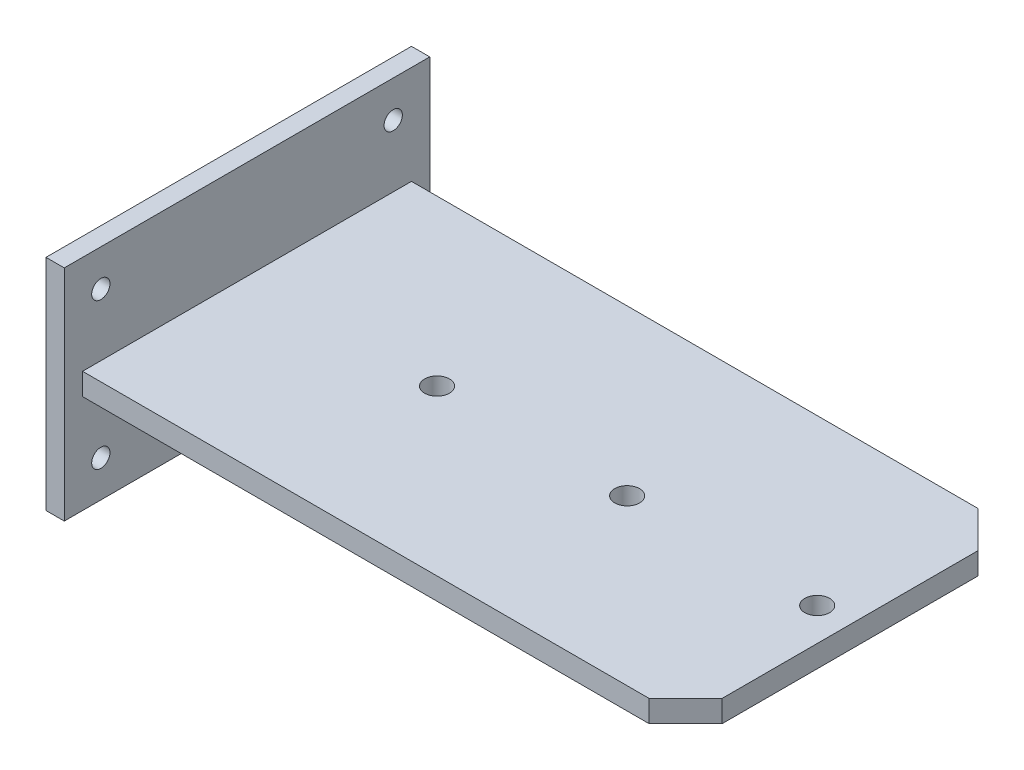
ISO-10303-21;
HEADER;
FILE_DESCRIPTION(('STEP AP214'),'2;1');
FILE_NAME('part.step','',(''),(''),'','','');
FILE_SCHEMA(('AUTOMOTIVE_DESIGN { 1 0 10303 214 1 1 1 1 }'));
ENDSEC;
DATA;
#1=APPLICATION_CONTEXT('core data for automotive mechanical design processes');
#2=APPLICATION_PROTOCOL_DEFINITION('international standard','automotive_design',2000,#1);
#3=PRODUCT_CONTEXT('',#1,'mechanical');
#4=PRODUCT('Part','Part','',(#3));
#5=PRODUCT_RELATED_PRODUCT_CATEGORY('part','',(#4));
#6=PRODUCT_DEFINITION_FORMATION('','',#4);
#7=PRODUCT_DEFINITION_CONTEXT('part definition',#1,'design');
#8=PRODUCT_DEFINITION('design','',#6,#7);
#9=PRODUCT_DEFINITION_SHAPE('','',#8);
#10=(LENGTH_UNIT() NAMED_UNIT(*) SI_UNIT(.MILLI.,.METRE.));
#11=(NAMED_UNIT(*) PLANE_ANGLE_UNIT() SI_UNIT($,.RADIAN.));
#12=(NAMED_UNIT(*) SI_UNIT($,.STERADIAN.) SOLID_ANGLE_UNIT());
#13=UNCERTAINTY_MEASURE_WITH_UNIT(LENGTH_MEASURE(1.E-05),#10,'distance_accuracy_value','');
#14=(GEOMETRIC_REPRESENTATION_CONTEXT(3) GLOBAL_UNCERTAINTY_ASSIGNED_CONTEXT((#13)) GLOBAL_UNIT_ASSIGNED_CONTEXT((#10,
#11,#12)) REPRESENTATION_CONTEXT('',''));
#15=CARTESIAN_POINT('',(0.,0.,0.));
#16=DIRECTION('',(0.,0.,1.));
#17=DIRECTION('',(1.,0.,0.));
#18=AXIS2_PLACEMENT_3D('',#15,#16,#17);
#19=CARTESIAN_POINT('',(5.,-30.,-50.));
#20=DIRECTION('',(0.,0.,1.));
#21=DIRECTION('',(1.,0.,0.));
#22=AXIS2_PLACEMENT_3D('',#19,#20,#21);
#23=PLANE('',#22);
#24=DIRECTION('',(0.,1.,0.));
#25=VECTOR('',#24,1.);
#26=CARTESIAN_POINT('',(0.,-30.,-50.));
#27=LINE('',#26,#25);
#28=CARTESIAN_POINT('',(0.,-30.,-50.));
#29=VERTEX_POINT('',#28);
#30=CARTESIAN_POINT('',(0.,30.,-50.));
#31=VERTEX_POINT('',#30);
#32=EDGE_CURVE('E174',#29,#31,#27,.T.);
#33=ORIENTED_EDGE('',*,*,#32,.T.);
#34=DIRECTION('',(-1.,0.,0.));
#35=VECTOR('',#34,1.);
#36=CARTESIAN_POINT('',(5.,30.,-50.));
#37=LINE('',#36,#35);
#38=CARTESIAN_POINT('',(5.,30.,-50.));
#39=VERTEX_POINT('',#38);
#40=EDGE_CURVE('E11',#39,#31,#37,.T.);
#41=ORIENTED_EDGE('',*,*,#40,.F.);
#42=DIRECTION('',(0.,1.,0.));
#43=VECTOR('',#42,1.);
#44=CARTESIAN_POINT('',(5.,-30.,-50.));
#45=LINE('',#44,#43);
#46=CARTESIAN_POINT('',(5.,-30.,-50.));
#47=VERTEX_POINT('',#46);
#48=EDGE_CURVE('E177',#47,#39,#45,.T.);
#49=ORIENTED_EDGE('',*,*,#48,.F.);
#50=DIRECTION('',(-1.,0.,0.));
#51=VECTOR('',#50,1.);
#52=CARTESIAN_POINT('',(5.,-30.,-50.));
#53=LINE('',#52,#51);
#54=EDGE_CURVE('E183',#47,#29,#53,.T.);
#55=ORIENTED_EDGE('',*,*,#54,.T.);
#56=EDGE_LOOP('',(#33,#41,#49,#55));
#57=FACE_BOUND('',#56,.T.);
#58=ADVANCED_FACE('F35',(#57),#23,.F.);
#59=CARTESIAN_POINT('',(5.,30.,50.));
#60=DIRECTION('',(0.,-1.,0.));
#61=DIRECTION('',(0.,0.,-1.));
#62=AXIS2_PLACEMENT_3D('',#59,#60,#61);
#63=PLANE('',#62);
#64=DIRECTION('',(0.,0.,1.));
#65=VECTOR('',#64,1.);
#66=CARTESIAN_POINT('',(0.,30.,50.));
#67=LINE('',#66,#65);
#68=CARTESIAN_POINT('',(0.,30.,50.));
#69=VERTEX_POINT('',#68);
#70=EDGE_CURVE('E186',#31,#69,#67,.T.);
#71=ORIENTED_EDGE('',*,*,#70,.T.);
#72=DIRECTION('',(-1.,0.,0.));
#73=VECTOR('',#72,1.);
#74=CARTESIAN_POINT('',(5.,30.,50.));
#75=LINE('',#74,#73);
#76=CARTESIAN_POINT('',(5.,30.,50.));
#77=VERTEX_POINT('',#76);
#78=EDGE_CURVE('E42',#77,#69,#75,.T.);
#79=ORIENTED_EDGE('',*,*,#78,.F.);
#80=DIRECTION('',(0.,0.,1.));
#81=VECTOR('',#80,1.);
#82=CARTESIAN_POINT('',(5.,30.,50.));
#83=LINE('',#82,#81);
#84=EDGE_CURVE('E86',#39,#77,#83,.T.);
#85=ORIENTED_EDGE('',*,*,#84,.F.);
#86=ORIENTED_EDGE('',*,*,#40,.T.);
#87=EDGE_LOOP('',(#71,#79,#85,#86));
#88=FACE_BOUND('',#87,.T.);
#89=ADVANCED_FACE('F215',(#88),#63,.F.);
#90=CARTESIAN_POINT('',(5.,-30.,50.));
#91=DIRECTION('',(0.,0.,-1.));
#92=DIRECTION('',(-1.,0.,0.));
#93=AXIS2_PLACEMENT_3D('',#90,#91,#92);
#94=PLANE('',#93);
#95=DIRECTION('',(0.,-1.,0.));
#96=VECTOR('',#95,1.);
#97=CARTESIAN_POINT('',(0.,-30.,50.));
#98=LINE('',#97,#96);
#99=CARTESIAN_POINT('',(0.,-30.,50.));
#100=VERTEX_POINT('',#99);
#101=EDGE_CURVE('E188',#69,#100,#98,.T.);
#102=ORIENTED_EDGE('',*,*,#101,.T.);
#103=DIRECTION('',(-1.,0.,0.));
#104=VECTOR('',#103,1.);
#105=CARTESIAN_POINT('',(5.,-30.,50.));
#106=LINE('',#105,#104);
#107=CARTESIAN_POINT('',(5.,-30.,50.));
#108=VERTEX_POINT('',#107);
#109=EDGE_CURVE('E192',#108,#100,#106,.T.);
#110=ORIENTED_EDGE('',*,*,#109,.F.);
#111=DIRECTION('',(0.,-1.,0.));
#112=VECTOR('',#111,1.);
#113=CARTESIAN_POINT('',(5.,-30.,50.));
#114=LINE('',#113,#112);
#115=EDGE_CURVE('E180',#77,#108,#114,.T.);
#116=ORIENTED_EDGE('',*,*,#115,.F.);
#117=ORIENTED_EDGE('',*,*,#78,.T.);
#118=EDGE_LOOP('',(#102,#110,#116,#117));
#119=FACE_BOUND('',#118,.T.);
#120=ADVANCED_FACE('F197',(#119),#94,.F.);
#121=CARTESIAN_POINT('',(5.,-30.,50.));
#122=DIRECTION('',(0.,1.,0.));
#123=DIRECTION('',(0.,0.,1.));
#124=AXIS2_PLACEMENT_3D('',#121,#122,#123);
#125=PLANE('',#124);
#126=DIRECTION('',(0.,0.,-1.));
#127=VECTOR('',#126,1.);
#128=CARTESIAN_POINT('',(0.,-30.,50.));
#129=LINE('',#128,#127);
#130=EDGE_CURVE('E79',#100,#29,#129,.T.);
#131=ORIENTED_EDGE('',*,*,#130,.T.);
#132=ORIENTED_EDGE('',*,*,#54,.F.);
#133=DIRECTION('',(0.,0.,-1.));
#134=VECTOR('',#133,1.);
#135=CARTESIAN_POINT('',(5.,-30.,50.));
#136=LINE('',#135,#134);
#137=EDGE_CURVE('E58',#108,#47,#136,.T.);
#138=ORIENTED_EDGE('',*,*,#137,.F.);
#139=ORIENTED_EDGE('',*,*,#109,.T.);
#140=EDGE_LOOP('',(#131,#132,#138,#139));
#141=FACE_BOUND('',#140,.T.);
#142=ADVANCED_FACE('F205',(#141),#125,.F.);
#143=CARTESIAN_POINT('',(5.,0.,0.));
#144=DIRECTION('',(-1.,0.,0.));
#145=DIRECTION('',(0.,0.,1.));
#146=AXIS2_PLACEMENT_3D('',#143,#144,#145);
#147=PLANE('',#146);
#148=DIRECTION('',(0.,-1.,0.));
#149=VECTOR('',#148,1.);
#150=CARTESIAN_POINT('',(5.,3.,-45.));
#151=LINE('',#150,#149);
#152=CARTESIAN_POINT('',(5.,3.,-45.));
#153=VERTEX_POINT('',#152);
#154=CARTESIAN_POINT('',(5.,-3.,-45.));
#155=VERTEX_POINT('',#154);
#156=EDGE_CURVE('E152',#153,#155,#151,.T.);
#157=ORIENTED_EDGE('',*,*,#156,.T.);
#158=DIRECTION('',(0.,0.,1.));
#159=VECTOR('',#158,1.);
#160=CARTESIAN_POINT('',(5.,-3.,-45.));
#161=LINE('',#160,#159);
#162=CARTESIAN_POINT('',(5.00000000000002,-3.,45.));
#163=VERTEX_POINT('',#162);
#164=EDGE_CURVE('E49',#155,#163,#161,.T.);
#165=ORIENTED_EDGE('',*,*,#164,.T.);
#166=DIRECTION('',(0.,-1.,0.));
#167=VECTOR('',#166,1.);
#168=CARTESIAN_POINT('',(5.00000000000002,3.,45.));
#169=LINE('',#168,#167);
#170=CARTESIAN_POINT('',(5.00000000000002,3.,45.));
#171=VERTEX_POINT('',#170);
#172=EDGE_CURVE('E427',#171,#163,#169,.T.);
#173=ORIENTED_EDGE('',*,*,#172,.F.);
#174=DIRECTION('',(0.,0.,1.));
#175=VECTOR('',#174,1.);
#176=CARTESIAN_POINT('',(5.,3.,-45.));
#177=LINE('',#176,#175);
#178=EDGE_CURVE('E410',#153,#171,#177,.T.);
#179=ORIENTED_EDGE('',*,*,#178,.F.);
#180=EDGE_LOOP('',(#157,#165,#173,#179));
#181=FACE_BOUND('',#180,.T.);
#182=CARTESIAN_POINT('',(5.,20.,-40.));
#183=DIRECTION('',(1.,0.,0.));
#184=DIRECTION('',(0.,0.,-1.));
#185=AXIS2_PLACEMENT_3D('',#182,#183,#184);
#186=CIRCLE('',#185,2.5);
#187=CARTESIAN_POINT('',(5.,20.,-42.5));
#188=VERTEX_POINT('',#187);
#189=EDGE_CURVE('E150',#188,#188,#186,.T.);
#190=ORIENTED_EDGE('',*,*,#189,.F.);
#191=EDGE_LOOP('',(#190));
#192=FACE_BOUND('',#191,.T.);
#193=CARTESIAN_POINT('',(5.,-20.,-40.));
#194=DIRECTION('',(1.,0.,0.));
#195=DIRECTION('',(0.,0.,-1.));
#196=AXIS2_PLACEMENT_3D('',#193,#194,#195);
#197=CIRCLE('',#196,2.5);
#198=CARTESIAN_POINT('',(5.,-20.,-42.5));
#199=VERTEX_POINT('',#198);
#200=EDGE_CURVE('E163',#199,#199,#197,.T.);
#201=ORIENTED_EDGE('',*,*,#200,.F.);
#202=EDGE_LOOP('',(#201));
#203=FACE_BOUND('',#202,.T.);
#204=CARTESIAN_POINT('',(5.,-20.,40.));
#205=DIRECTION('',(1.,0.,0.));
#206=DIRECTION('',(0.,0.,-1.));
#207=AXIS2_PLACEMENT_3D('',#204,#205,#206);
#208=CIRCLE('',#207,2.5);
#209=CARTESIAN_POINT('',(5.,-20.,37.5));
#210=VERTEX_POINT('',#209);
#211=EDGE_CURVE('E156',#210,#210,#208,.T.);
#212=ORIENTED_EDGE('',*,*,#211,.F.);
#213=EDGE_LOOP('',(#212));
#214=FACE_BOUND('',#213,.T.);
#215=CARTESIAN_POINT('',(5.,20.,40.));
#216=DIRECTION('',(1.,0.,0.));
#217=DIRECTION('',(0.,0.,-1.));
#218=AXIS2_PLACEMENT_3D('',#215,#216,#217);
#219=CIRCLE('',#218,2.5);
#220=CARTESIAN_POINT('',(5.,20.,37.5));
#221=VERTEX_POINT('',#220);
#222=EDGE_CURVE('E171',#221,#221,#219,.T.);
#223=ORIENTED_EDGE('',*,*,#222,.F.);
#224=EDGE_LOOP('',(#223));
#225=FACE_BOUND('',#224,.T.);
#226=ORIENTED_EDGE('',*,*,#48,.T.);
#227=ORIENTED_EDGE('',*,*,#84,.T.);
#228=ORIENTED_EDGE('',*,*,#115,.T.);
#229=ORIENTED_EDGE('',*,*,#137,.T.);
#230=EDGE_LOOP('',(#226,#227,#228,#229));
#231=FACE_BOUND('',#230,.T.);
#232=ADVANCED_FACE('F207',(#181,#192,#203,#214,#225,#231),#147,.F.);
#233=CARTESIAN_POINT('',(0.,0.,0.));
#234=DIRECTION('',(-1.,0.,0.));
#235=DIRECTION('',(0.,0.,1.));
#236=AXIS2_PLACEMENT_3D('',#233,#234,#235);
#237=PLANE('',#236);
#238=CARTESIAN_POINT('',(0.,20.,-40.));
#239=DIRECTION('',(-1.,0.,0.));
#240=DIRECTION('',(0.,0.,1.));
#241=AXIS2_PLACEMENT_3D('',#238,#239,#240);
#242=CIRCLE('',#241,2.5);
#243=CARTESIAN_POINT('',(0.,20.,-37.5));
#244=VERTEX_POINT('',#243);
#245=EDGE_CURVE('E147',#244,#244,#242,.F.);
#246=ORIENTED_EDGE('',*,*,#245,.T.);
#247=EDGE_LOOP('',(#246));
#248=FACE_BOUND('',#247,.T.);
#249=CARTESIAN_POINT('',(0.,-20.,-40.));
#250=DIRECTION('',(-1.,0.,0.));
#251=DIRECTION('',(0.,0.,1.));
#252=AXIS2_PLACEMENT_3D('',#249,#250,#251);
#253=CIRCLE('',#252,2.5);
#254=CARTESIAN_POINT('',(0.,-20.,-37.5));
#255=VERTEX_POINT('',#254);
#256=EDGE_CURVE('E166',#255,#255,#253,.F.);
#257=ORIENTED_EDGE('',*,*,#256,.T.);
#258=EDGE_LOOP('',(#257));
#259=FACE_BOUND('',#258,.T.);
#260=CARTESIAN_POINT('',(0.,-20.,40.));
#261=DIRECTION('',(-1.,0.,0.));
#262=DIRECTION('',(0.,0.,1.));
#263=AXIS2_PLACEMENT_3D('',#260,#261,#262);
#264=CIRCLE('',#263,2.5);
#265=CARTESIAN_POINT('',(0.,-20.,42.5));
#266=VERTEX_POINT('',#265);
#267=EDGE_CURVE('E160',#266,#266,#264,.F.);
#268=ORIENTED_EDGE('',*,*,#267,.T.);
#269=EDGE_LOOP('',(#268));
#270=FACE_BOUND('',#269,.T.);
#271=CARTESIAN_POINT('',(0.,20.,40.));
#272=DIRECTION('',(-1.,0.,0.));
#273=DIRECTION('',(0.,0.,1.));
#274=AXIS2_PLACEMENT_3D('',#271,#272,#273);
#275=CIRCLE('',#274,2.5);
#276=CARTESIAN_POINT('',(0.,20.,42.5));
#277=VERTEX_POINT('',#276);
#278=EDGE_CURVE('E159',#277,#277,#275,.F.);
#279=ORIENTED_EDGE('',*,*,#278,.T.);
#280=EDGE_LOOP('',(#279));
#281=FACE_BOUND('',#280,.T.);
#282=ORIENTED_EDGE('',*,*,#32,.F.);
#283=ORIENTED_EDGE('',*,*,#130,.F.);
#284=ORIENTED_EDGE('',*,*,#101,.F.);
#285=ORIENTED_EDGE('',*,*,#70,.F.);
#286=EDGE_LOOP('',(#282,#283,#284,#285));
#287=FACE_BOUND('',#286,.T.);
#288=ADVANCED_FACE('F201',(#248,#259,#270,#281,#287),#237,.T.);
#289=CARTESIAN_POINT('',(-0.00100000000000013,20.,40.));
#290=DIRECTION('',(1.,0.,0.));
#291=DIRECTION('',(0.,0.,-1.));
#292=AXIS2_PLACEMENT_3D('',#289,#290,#291);
#293=CYLINDRICAL_SURFACE('',#292,2.5);
#294=ORIENTED_EDGE('',*,*,#278,.F.);
#295=EDGE_LOOP('',(#294));
#296=FACE_BOUND('',#295,.T.);
#297=ORIENTED_EDGE('',*,*,#222,.T.);
#298=EDGE_LOOP('',(#297));
#299=FACE_BOUND('',#298,.T.);
#300=ADVANCED_FACE('F242',(#296,#299),#293,.F.);
#301=CARTESIAN_POINT('',(-0.00100000000000013,-20.,40.));
#302=DIRECTION('',(1.,0.,0.));
#303=DIRECTION('',(0.,0.,-1.));
#304=AXIS2_PLACEMENT_3D('',#301,#302,#303);
#305=CYLINDRICAL_SURFACE('',#304,2.5);
#306=ORIENTED_EDGE('',*,*,#267,.F.);
#307=EDGE_LOOP('',(#306));
#308=FACE_BOUND('',#307,.T.);
#309=ORIENTED_EDGE('',*,*,#211,.T.);
#310=EDGE_LOOP('',(#309));
#311=FACE_BOUND('',#310,.T.);
#312=ADVANCED_FACE('F251',(#308,#311),#305,.F.);
#313=CARTESIAN_POINT('',(-0.00100000000000013,-20.,-40.));
#314=DIRECTION('',(1.,0.,0.));
#315=DIRECTION('',(0.,0.,-1.));
#316=AXIS2_PLACEMENT_3D('',#313,#314,#315);
#317=CYLINDRICAL_SURFACE('',#316,2.5);
#318=ORIENTED_EDGE('',*,*,#256,.F.);
#319=EDGE_LOOP('',(#318));
#320=FACE_BOUND('',#319,.T.);
#321=ORIENTED_EDGE('',*,*,#200,.T.);
#322=EDGE_LOOP('',(#321));
#323=FACE_BOUND('',#322,.T.);
#324=ADVANCED_FACE('F261',(#320,#323),#317,.F.);
#325=CARTESIAN_POINT('',(-0.00100000000000013,20.,-40.));
#326=DIRECTION('',(1.,0.,0.));
#327=DIRECTION('',(0.,0.,-1.));
#328=AXIS2_PLACEMENT_3D('',#325,#326,#327);
#329=CYLINDRICAL_SURFACE('',#328,2.5);
#330=ORIENTED_EDGE('',*,*,#245,.F.);
#331=EDGE_LOOP('',(#330));
#332=FACE_BOUND('',#331,.T.);
#333=ORIENTED_EDGE('',*,*,#189,.T.);
#334=EDGE_LOOP('',(#333));
#335=FACE_BOUND('',#334,.T.);
#336=ADVANCED_FACE('F271',(#332,#335),#329,.F.);
#337=CARTESIAN_POINT('',(170.,3.,35.));
#338=DIRECTION('',(-1.,0.,0.));
#339=DIRECTION('',(0.,0.,1.));
#340=AXIS2_PLACEMENT_3D('',#337,#338,#339);
#341=PLANE('',#340);
#342=DIRECTION('',(0.,0.,-1.));
#343=VECTOR('',#342,1.);
#344=CARTESIAN_POINT('',(170.,-3.,35.));
#345=LINE('',#344,#343);
#346=CARTESIAN_POINT('',(170.,-3.,35.));
#347=VERTEX_POINT('',#346);
#348=CARTESIAN_POINT('',(170.,-3.,-35.));
#349=VERTEX_POINT('',#348);
#350=EDGE_CURVE('E146',#347,#349,#345,.T.);
#351=ORIENTED_EDGE('',*,*,#350,.T.);
#352=DIRECTION('',(0.,-1.,0.));
#353=VECTOR('',#352,1.);
#354=CARTESIAN_POINT('',(170.,3.,-35.));
#355=LINE('',#354,#353);
#356=CARTESIAN_POINT('',(170.,3.,-35.));
#357=VERTEX_POINT('',#356);
#358=EDGE_CURVE('E126',#357,#349,#355,.T.);
#359=ORIENTED_EDGE('',*,*,#358,.F.);
#360=DIRECTION('',(0.,0.,-1.));
#361=VECTOR('',#360,1.);
#362=CARTESIAN_POINT('',(170.,3.,35.));
#363=LINE('',#362,#361);
#364=CARTESIAN_POINT('',(170.,3.,35.));
#365=VERTEX_POINT('',#364);
#366=EDGE_CURVE('E133',#365,#357,#363,.T.);
#367=ORIENTED_EDGE('',*,*,#366,.F.);
#368=DIRECTION('',(0.,-1.,0.));
#369=VECTOR('',#368,1.);
#370=CARTESIAN_POINT('',(170.,3.,35.));
#371=LINE('',#370,#369);
#372=EDGE_CURVE('E414',#365,#347,#371,.T.);
#373=ORIENTED_EDGE('',*,*,#372,.T.);
#374=EDGE_LOOP('',(#351,#359,#367,#373));
#375=FACE_BOUND('',#374,.T.);
#376=ADVANCED_FACE('F144',(#375),#341,.F.);
#377=CARTESIAN_POINT('',(170.,3.,-35.));
#378=DIRECTION('',(-0.707106781186547,0.,0.707106781186548));
#379=DIRECTION('',(0.707106781186548,0.,0.707106781186547));
#380=AXIS2_PLACEMENT_3D('',#377,#378,#379);
#381=PLANE('',#380);
#382=DIRECTION('',(-0.707106781186548,0.,-0.707106781186547));
#383=VECTOR('',#382,1.);
#384=CARTESIAN_POINT('',(170.,-3.,-35.));
#385=LINE('',#384,#383);
#386=CARTESIAN_POINT('',(160.,-3.,-45.));
#387=VERTEX_POINT('',#386);
#388=EDGE_CURVE('E393',#349,#387,#385,.T.);
#389=ORIENTED_EDGE('',*,*,#388,.T.);
#390=DIRECTION('',(0.,-1.,0.));
#391=VECTOR('',#390,1.);
#392=CARTESIAN_POINT('',(160.,3.,-45.));
#393=LINE('',#392,#391);
#394=CARTESIAN_POINT('',(160.,3.,-45.));
#395=VERTEX_POINT('',#394);
#396=EDGE_CURVE('E129',#395,#387,#393,.T.);
#397=ORIENTED_EDGE('',*,*,#396,.F.);
#398=DIRECTION('',(-0.707106781186548,0.,-0.707106781186547));
#399=VECTOR('',#398,1.);
#400=CARTESIAN_POINT('',(170.,3.,-35.));
#401=LINE('',#400,#399);
#402=EDGE_CURVE('E122',#357,#395,#401,.T.);
#403=ORIENTED_EDGE('',*,*,#402,.F.);
#404=ORIENTED_EDGE('',*,*,#358,.T.);
#405=EDGE_LOOP('',(#389,#397,#403,#404));
#406=FACE_BOUND('',#405,.T.);
#407=ADVANCED_FACE('F124',(#406),#381,.F.);
#408=CARTESIAN_POINT('',(160.,3.,-45.));
#409=DIRECTION('',(0.,0.,1.));
#410=DIRECTION('',(1.,0.,0.));
#411=AXIS2_PLACEMENT_3D('',#408,#409,#410);
#412=PLANE('',#411);
#413=DIRECTION('',(-1.,0.,0.));
#414=VECTOR('',#413,1.);
#415=CARTESIAN_POINT('',(160.,-3.,-45.));
#416=LINE('',#415,#414);
#417=EDGE_CURVE('E417',#387,#155,#416,.T.);
#418=ORIENTED_EDGE('',*,*,#417,.T.);
#419=ORIENTED_EDGE('',*,*,#156,.F.);
#420=DIRECTION('',(-1.,0.,0.));
#421=VECTOR('',#420,1.);
#422=CARTESIAN_POINT('',(160.,3.,-45.));
#423=LINE('',#422,#421);
#424=EDGE_CURVE('E132',#395,#153,#423,.T.);
#425=ORIENTED_EDGE('',*,*,#424,.F.);
#426=ORIENTED_EDGE('',*,*,#396,.T.);
#427=EDGE_LOOP('',(#418,#419,#425,#426));
#428=FACE_BOUND('',#427,.T.);
#429=ADVANCED_FACE('F303',(#428),#412,.F.);
#430=CARTESIAN_POINT('',(5.00000000000002,3.,45.));
#431=DIRECTION('',(0.,0.,-1.));
#432=DIRECTION('',(-1.,0.,0.));
#433=AXIS2_PLACEMENT_3D('',#430,#431,#432);
#434=PLANE('',#433);
#435=DIRECTION('',(1.,0.,0.));
#436=VECTOR('',#435,1.);
#437=CARTESIAN_POINT('',(5.00000000000002,-3.,45.));
#438=LINE('',#437,#436);
#439=CARTESIAN_POINT('',(160.,-3.,45.));
#440=VERTEX_POINT('',#439);
#441=EDGE_CURVE('E420',#163,#440,#438,.T.);
#442=ORIENTED_EDGE('',*,*,#441,.T.);
#443=DIRECTION('',(0.,-1.,0.));
#444=VECTOR('',#443,1.);
#445=CARTESIAN_POINT('',(160.,3.,45.));
#446=LINE('',#445,#444);
#447=CARTESIAN_POINT('',(160.,3.,45.));
#448=VERTEX_POINT('',#447);
#449=EDGE_CURVE('E424',#448,#440,#446,.T.);
#450=ORIENTED_EDGE('',*,*,#449,.F.);
#451=DIRECTION('',(1.,0.,0.));
#452=VECTOR('',#451,1.);
#453=CARTESIAN_POINT('',(5.00000000000002,3.,45.));
#454=LINE('',#453,#452);
#455=EDGE_CURVE('E412',#171,#448,#454,.T.);
#456=ORIENTED_EDGE('',*,*,#455,.F.);
#457=ORIENTED_EDGE('',*,*,#172,.T.);
#458=EDGE_LOOP('',(#442,#450,#456,#457));
#459=FACE_BOUND('',#458,.T.);
#460=ADVANCED_FACE('F312',(#459),#434,.F.);
#461=CARTESIAN_POINT('',(160.,3.,45.));
#462=DIRECTION('',(-0.707106781186547,0.,-0.707106781186548));
#463=DIRECTION('',(-0.707106781186548,0.,0.707106781186547));
#464=AXIS2_PLACEMENT_3D('',#461,#462,#463);
#465=PLANE('',#464);
#466=DIRECTION('',(0.707106781186548,0.,-0.707106781186547));
#467=VECTOR('',#466,1.);
#468=CARTESIAN_POINT('',(160.,-3.,45.));
#469=LINE('',#468,#467);
#470=EDGE_CURVE('E142',#440,#347,#469,.T.);
#471=ORIENTED_EDGE('',*,*,#470,.T.);
#472=ORIENTED_EDGE('',*,*,#372,.F.);
#473=DIRECTION('',(0.707106781186548,0.,-0.707106781186547));
#474=VECTOR('',#473,1.);
#475=CARTESIAN_POINT('',(160.,3.,45.));
#476=LINE('',#475,#474);
#477=EDGE_CURVE('E138',#448,#365,#476,.T.);
#478=ORIENTED_EDGE('',*,*,#477,.F.);
#479=ORIENTED_EDGE('',*,*,#449,.T.);
#480=EDGE_LOOP('',(#471,#472,#478,#479));
#481=FACE_BOUND('',#480,.T.);
#482=ADVANCED_FACE('F322',(#481),#465,.F.);
#483=CARTESIAN_POINT('',(0.,3.,0.));
#484=DIRECTION('',(0.,1.,0.));
#485=DIRECTION('',(0.,0.,1.));
#486=AXIS2_PLACEMENT_3D('',#483,#484,#485);
#487=PLANE('',#486);
#488=CARTESIAN_POINT('',(57.,3.,0.));
#489=DIRECTION('',(0.,1.,0.));
#490=DIRECTION('',(0.,0.,1.));
#491=AXIS2_PLACEMENT_3D('',#488,#489,#490);
#492=CIRCLE('',#491,3.4);
#493=CARTESIAN_POINT('',(57.,3.,3.40000000000001));
#494=VERTEX_POINT('',#493);
#495=EDGE_CURVE('E388',#494,#494,#492,.T.);
#496=ORIENTED_EDGE('',*,*,#495,.F.);
#497=EDGE_LOOP('',(#496));
#498=FACE_BOUND('',#497,.T.);
#499=CARTESIAN_POINT('',(109.,3.,0.));
#500=DIRECTION('',(0.,1.,0.));
#501=DIRECTION('',(0.,0.,1.));
#502=AXIS2_PLACEMENT_3D('',#499,#500,#501);
#503=CIRCLE('',#502,3.4);
#504=CARTESIAN_POINT('',(109.,3.,3.40000000000001));
#505=VERTEX_POINT('',#504);
#506=EDGE_CURVE('E398',#505,#505,#503,.T.);
#507=ORIENTED_EDGE('',*,*,#506,.F.);
#508=EDGE_LOOP('',(#507));
#509=FACE_BOUND('',#508,.T.);
#510=CARTESIAN_POINT('',(161.,3.,0.));
#511=DIRECTION('',(0.,1.,0.));
#512=DIRECTION('',(0.,0.,1.));
#513=AXIS2_PLACEMENT_3D('',#510,#511,#512);
#514=CIRCLE('',#513,3.4);
#515=CARTESIAN_POINT('',(161.,3.,3.4));
#516=VERTEX_POINT('',#515);
#517=EDGE_CURVE('E404',#516,#516,#514,.T.);
#518=ORIENTED_EDGE('',*,*,#517,.F.);
#519=EDGE_LOOP('',(#518));
#520=FACE_BOUND('',#519,.T.);
#521=ORIENTED_EDGE('',*,*,#366,.T.);
#522=ORIENTED_EDGE('',*,*,#402,.T.);
#523=ORIENTED_EDGE('',*,*,#424,.T.);
#524=ORIENTED_EDGE('',*,*,#178,.T.);
#525=ORIENTED_EDGE('',*,*,#455,.T.);
#526=ORIENTED_EDGE('',*,*,#477,.T.);
#527=EDGE_LOOP('',(#521,#522,#523,#524,#525,#526));
#528=FACE_BOUND('',#527,.T.);
#529=ADVANCED_FACE('F136',(#498,#509,#520,#528),#487,.T.);
#530=CARTESIAN_POINT('',(0.,-3.,0.));
#531=DIRECTION('',(0.,1.,0.));
#532=DIRECTION('',(0.,0.,1.));
#533=AXIS2_PLACEMENT_3D('',#530,#531,#532);
#534=PLANE('',#533);
#535=CARTESIAN_POINT('',(57.,-3.,0.));
#536=DIRECTION('',(0.,1.,0.));
#537=DIRECTION('',(0.,0.,1.));
#538=AXIS2_PLACEMENT_3D('',#535,#536,#537);
#539=CIRCLE('',#538,3.4);
#540=CARTESIAN_POINT('',(57.,-3.,3.40000000000001));
#541=VERTEX_POINT('',#540);
#542=EDGE_CURVE('E391',#541,#541,#539,.F.);
#543=ORIENTED_EDGE('',*,*,#542,.F.);
#544=EDGE_LOOP('',(#543));
#545=FACE_BOUND('',#544,.T.);
#546=CARTESIAN_POINT('',(109.,-3.,0.));
#547=DIRECTION('',(0.,1.,0.));
#548=DIRECTION('',(0.,0.,1.));
#549=AXIS2_PLACEMENT_3D('',#546,#547,#548);
#550=CIRCLE('',#549,3.4);
#551=CARTESIAN_POINT('',(109.,-3.,3.40000000000001));
#552=VERTEX_POINT('',#551);
#553=EDGE_CURVE('E395',#552,#552,#550,.F.);
#554=ORIENTED_EDGE('',*,*,#553,.F.);
#555=EDGE_LOOP('',(#554));
#556=FACE_BOUND('',#555,.T.);
#557=CARTESIAN_POINT('',(161.,-3.,0.));
#558=DIRECTION('',(0.,1.,0.));
#559=DIRECTION('',(0.,0.,1.));
#560=AXIS2_PLACEMENT_3D('',#557,#558,#559);
#561=CIRCLE('',#560,3.4);
#562=CARTESIAN_POINT('',(161.,-3.,3.4));
#563=VERTEX_POINT('',#562);
#564=EDGE_CURVE('E401',#563,#563,#561,.F.);
#565=ORIENTED_EDGE('',*,*,#564,.F.);
#566=EDGE_LOOP('',(#565));
#567=FACE_BOUND('',#566,.T.);
#568=ORIENTED_EDGE('',*,*,#350,.F.);
#569=ORIENTED_EDGE('',*,*,#470,.F.);
#570=ORIENTED_EDGE('',*,*,#441,.F.);
#571=ORIENTED_EDGE('',*,*,#164,.F.);
#572=ORIENTED_EDGE('',*,*,#417,.F.);
#573=ORIENTED_EDGE('',*,*,#388,.F.);
#574=EDGE_LOOP('',(#568,#569,#570,#571,#572,#573));
#575=FACE_BOUND('',#574,.T.);
#576=ADVANCED_FACE('F341',(#545,#556,#567,#575),#534,.F.);
#577=CARTESIAN_POINT('',(161.,-30.001,0.));
#578=DIRECTION('',(0.,1.,0.));
#579=DIRECTION('',(0.,0.,1.));
#580=AXIS2_PLACEMENT_3D('',#577,#578,#579);
#581=CYLINDRICAL_SURFACE('',#580,3.4);
#582=ORIENTED_EDGE('',*,*,#517,.T.);
#583=EDGE_LOOP('',(#582));
#584=FACE_BOUND('',#583,.T.);
#585=ORIENTED_EDGE('',*,*,#564,.T.);
#586=EDGE_LOOP('',(#585));
#587=FACE_BOUND('',#586,.T.);
#588=ADVANCED_FACE('F351',(#584,#587),#581,.F.);
#589=CARTESIAN_POINT('',(109.,-30.001,0.));
#590=DIRECTION('',(0.,1.,0.));
#591=DIRECTION('',(0.,0.,1.));
#592=AXIS2_PLACEMENT_3D('',#589,#590,#591);
#593=CYLINDRICAL_SURFACE('',#592,3.4);
#594=ORIENTED_EDGE('',*,*,#506,.T.);
#595=EDGE_LOOP('',(#594));
#596=FACE_BOUND('',#595,.T.);
#597=ORIENTED_EDGE('',*,*,#553,.T.);
#598=EDGE_LOOP('',(#597));
#599=FACE_BOUND('',#598,.T.);
#600=ADVANCED_FACE('F361',(#596,#599),#593,.F.);
#601=CARTESIAN_POINT('',(57.,-30.001,0.));
#602=DIRECTION('',(0.,1.,0.));
#603=DIRECTION('',(0.,0.,1.));
#604=AXIS2_PLACEMENT_3D('',#601,#602,#603);
#605=CYLINDRICAL_SURFACE('',#604,3.4);
#606=ORIENTED_EDGE('',*,*,#495,.T.);
#607=EDGE_LOOP('',(#606));
#608=FACE_BOUND('',#607,.T.);
#609=ORIENTED_EDGE('',*,*,#542,.T.);
#610=EDGE_LOOP('',(#609));
#611=FACE_BOUND('',#610,.T.);
#612=ADVANCED_FACE('F371',(#608,#611),#605,.F.);
#613=CLOSED_SHELL('',(#58,#89,#120,#142,#232,#288,#300,#312,#324,#336,#376,#407,#429,#460,#482,
#529,#576,#588,#600,#612));
#614=MANIFOLD_SOLID_BREP('B2',#613);
#615=ADVANCED_BREP_SHAPE_REPRESENTATION('',(#18,#614),#14);
#616=SHAPE_DEFINITION_REPRESENTATION(#9,#615);
ENDSEC;
END-ISO-10303-21;
